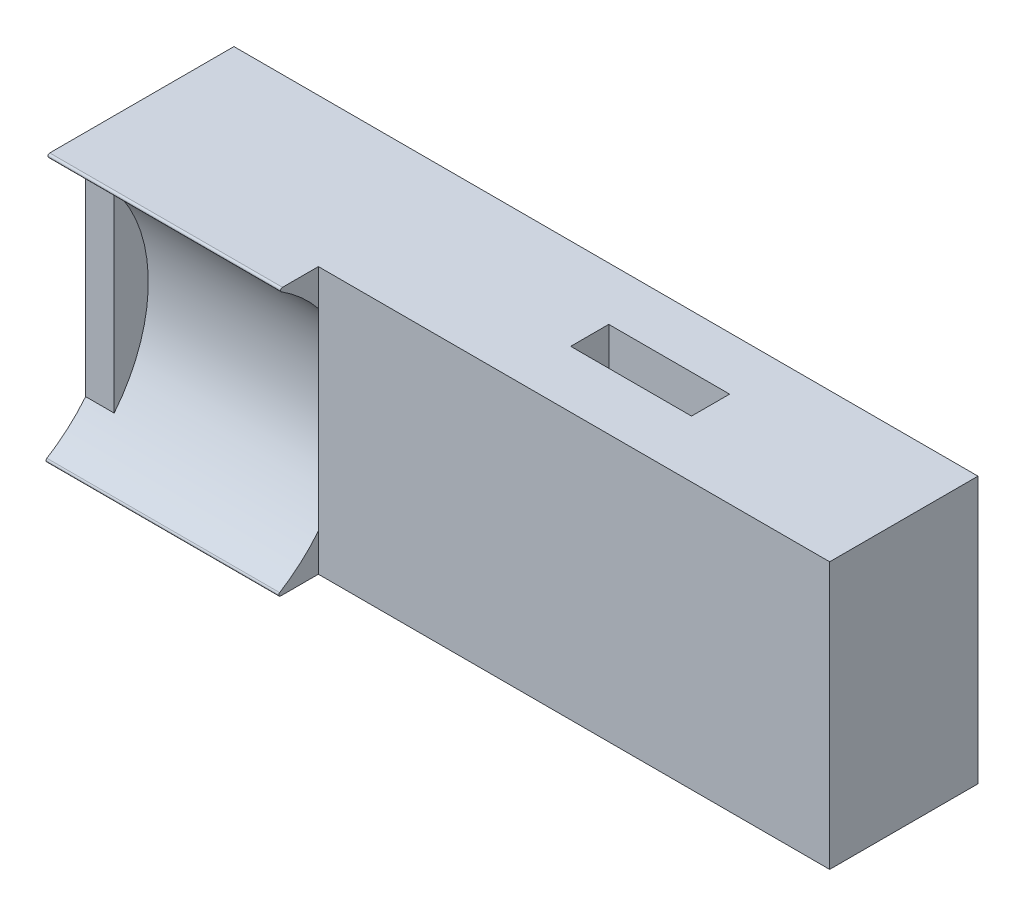
ISO-10303-21;
HEADER;
FILE_DESCRIPTION(('STEP AP214'),'2;1');
FILE_NAME('part.step','',(''),(''),'','','');
FILE_SCHEMA(('AUTOMOTIVE_DESIGN { 1 0 10303 214 1 1 1 1 }'));
ENDSEC;
DATA;
#1=APPLICATION_CONTEXT('core data for automotive mechanical design processes');
#2=APPLICATION_PROTOCOL_DEFINITION('international standard','automotive_design',2000,#1);
#3=PRODUCT_CONTEXT('',#1,'mechanical');
#4=PRODUCT('Part','Part','',(#3));
#5=PRODUCT_RELATED_PRODUCT_CATEGORY('part','',(#4));
#6=PRODUCT_DEFINITION_FORMATION('','',#4);
#7=PRODUCT_DEFINITION_CONTEXT('part definition',#1,'design');
#8=PRODUCT_DEFINITION('design','',#6,#7);
#9=PRODUCT_DEFINITION_SHAPE('','',#8);
#10=(LENGTH_UNIT() NAMED_UNIT(*) SI_UNIT(.MILLI.,.METRE.));
#11=(NAMED_UNIT(*) PLANE_ANGLE_UNIT() SI_UNIT($,.RADIAN.));
#12=(NAMED_UNIT(*) SI_UNIT($,.STERADIAN.) SOLID_ANGLE_UNIT());
#13=UNCERTAINTY_MEASURE_WITH_UNIT(LENGTH_MEASURE(1.E-05),#10,'distance_accuracy_value','');
#14=(GEOMETRIC_REPRESENTATION_CONTEXT(3) GLOBAL_UNCERTAINTY_ASSIGNED_CONTEXT((#13)) GLOBAL_UNIT_ASSIGNED_CONTEXT((#10,
#11,#12)) REPRESENTATION_CONTEXT('',''));
#15=CARTESIAN_POINT('',(0.,0.,0.));
#16=DIRECTION('',(0.,0.,1.));
#17=DIRECTION('',(1.,0.,0.));
#18=AXIS2_PLACEMENT_3D('',#15,#16,#17);
#19=CARTESIAN_POINT('',(-0.0551696547217584,-0.0306395827444961,-10.0199708088483));
#20=DIRECTION('',(1.,0.,0.));
#21=DIRECTION('',(0.,1.,0.));
#22=AXIS2_PLACEMENT_3D('',#19,#20,#21);
#23=PLANE('',#22);
#24=CARTESIAN_POINT('',(-0.0551696547217584,0.,0.));
#25=DIRECTION('',(-1.,0.,0.));
#26=DIRECTION('',(0.,1.,0.));
#27=AXIS2_PLACEMENT_3D('',#24,#25,#26);
#28=CIRCLE('',#27,8.04);
#29=CARTESIAN_POINT('',(-0.0551696547217584,5.06265492472644,-6.24588865680002));
#30=VERTEX_POINT('',#29);
#31=CARTESIAN_POINT('',(-0.0551696547217584,-5.06265492472644,-6.24588865680002));
#32=VERTEX_POINT('',#31);
#33=EDGE_CURVE('E178',#30,#32,#28,.T.);
#34=ORIENTED_EDGE('',*,*,#33,.T.);
#35=DIRECTION('',(0.,1.,0.));
#36=VECTOR('',#35,1.);
#37=CARTESIAN_POINT('',(-0.0551696547217584,3.4693604172555,-6.24588865680002));
#38=LINE('',#37,#36);
#39=EDGE_CURVE('E151',#32,#30,#38,.T.);
#40=ORIENTED_EDGE('',*,*,#39,.T.);
#41=EDGE_LOOP('',(#34,#40));
#42=FACE_BOUND('',#41,.T.);
#43=ADVANCED_FACE('F16',(#42),#23,.F.);
#44=CARTESIAN_POINT('',(-0.0551696547217584,-7.0306395827445,-6.));
#45=DIRECTION('',(0.,-1.,0.));
#46=DIRECTION('',(0.,0.,-1.));
#47=AXIS2_PLACEMENT_3D('',#44,#45,#46);
#48=PLANE('',#47);
#49=DIRECTION('',(0.,0.,-1.));
#50=VECTOR('',#49,1.);
#51=CARTESIAN_POINT('',(16.5523303452782,-7.0306395827445,-7.62294432840001));
#52=LINE('',#51,#50);
#53=CARTESIAN_POINT('',(16.5523303452782,-7.0306395827445,-9.24588865680002));
#54=VERTEX_POINT('',#53);
#55=CARTESIAN_POINT('',(16.5523303452782,-7.03063958274449,-11.2458886568));
#56=VERTEX_POINT('',#55);
#57=EDGE_CURVE('E276',#54,#56,#52,.T.);
#58=ORIENTED_EDGE('',*,*,#57,.T.);
#59=DIRECTION('',(-1.,0.,0.));
#60=VECTOR('',#59,1.);
#61=CARTESIAN_POINT('',(8.24858034527824,-7.03063958274449,-11.2458886568));
#62=LINE('',#61,#60);
#63=CARTESIAN_POINT('',(10.2023303452782,-7.03063958274449,-11.2458886568));
#64=VERTEX_POINT('',#63);
#65=EDGE_CURVE('E278',#56,#64,#62,.T.);
#66=ORIENTED_EDGE('',*,*,#65,.T.);
#67=DIRECTION('',(0.,0.,1.));
#68=VECTOR('',#67,1.);
#69=CARTESIAN_POINT('',(10.2023303452782,-7.0306395827445,-8.62294432840002));
#70=LINE('',#69,#68);
#71=CARTESIAN_POINT('',(10.2023303452782,-7.0306395827445,-9.24588865680001));
#72=VERTEX_POINT('',#71);
#73=EDGE_CURVE('E210',#64,#72,#70,.T.);
#74=ORIENTED_EDGE('',*,*,#73,.T.);
#75=DIRECTION('',(1.,0.,0.));
#76=VECTOR('',#75,1.);
#77=CARTESIAN_POINT('',(5.07358034527824,-7.0306395827445,-9.24588865680001));
#78=LINE('',#77,#76);
#79=EDGE_CURVE('E243',#72,#54,#78,.T.);
#80=ORIENTED_EDGE('',*,*,#79,.T.);
#81=EDGE_LOOP('',(#58,#66,#74,#80));
#82=FACE_BOUND('',#81,.T.);
#83=DIRECTION('',(1.,0.,0.));
#84=VECTOR('',#83,1.);
#85=CARTESIAN_POINT('',(-10.05,-7.0306395827445,-4.2621065702026));
#86=LINE('',#85,#84);
#87=CARTESIAN_POINT('',(-12.285,-7.0306395827445,-4.2621065702026));
#88=VERTEX_POINT('',#87);
#89=CARTESIAN_POINT('',(-0.0551696547217584,-7.0306395827445,-4.2621065702026));
#90=VERTEX_POINT('',#89);
#91=EDGE_CURVE('E294',#88,#90,#86,.T.);
#92=ORIENTED_EDGE('',*,*,#91,.F.);
#93=DIRECTION('',(0.,0.,1.));
#94=VECTOR('',#93,1.);
#95=CARTESIAN_POINT('',(-12.285,-7.03063958274449,-14.0399416176966));
#96=LINE('',#95,#94);
#97=CARTESIAN_POINT('',(-12.285,-7.03063958274449,-14.0399416176966));
#98=VERTEX_POINT('',#97);
#99=EDGE_CURVE('E204',#98,#88,#96,.T.);
#100=ORIENTED_EDGE('',*,*,#99,.F.);
#101=DIRECTION('',(-1.,0.,0.));
#102=VECTOR('',#101,1.);
#103=CARTESIAN_POINT('',(-10.05,-7.03063958274449,-14.0399416176966));
#104=LINE('',#103,#102);
#105=CARTESIAN_POINT('',(26.8098303452782,-7.03063958274449,-14.0399416176966));
#106=VERTEX_POINT('',#105);
#107=EDGE_CURVE('E11',#106,#98,#104,.T.);
#108=ORIENTED_EDGE('',*,*,#107,.F.);
#109=DIRECTION('',(0.,0.,-1.));
#110=VECTOR('',#109,1.);
#111=CARTESIAN_POINT('',(26.8098303452782,-7.0306395827445,-3.90021884739129));
#112=LINE('',#111,#110);
#113=CARTESIAN_POINT('',(26.8098303452782,-7.0306395827445,-6.24588865680002));
#114=VERTEX_POINT('',#113);
#115=EDGE_CURVE('E247',#114,#106,#112,.T.);
#116=ORIENTED_EDGE('',*,*,#115,.F.);
#117=DIRECTION('',(-1.,0.,0.));
#118=VECTOR('',#117,1.);
#119=CARTESIAN_POINT('',(-0.0551696547217584,-7.0306395827445,-6.24588865680002));
#120=LINE('',#119,#118);
#121=CARTESIAN_POINT('',(-0.0551696547217584,-7.0306395827445,-6.24588865680002));
#122=VERTEX_POINT('',#121);
#123=EDGE_CURVE('E176',#114,#122,#120,.T.);
#124=ORIENTED_EDGE('',*,*,#123,.T.);
#125=DIRECTION('',(0.,0.,-1.));
#126=VECTOR('',#125,1.);
#127=CARTESIAN_POINT('',(-0.0551696547217584,-7.03063958274449,-14.0399416176966));
#128=LINE('',#127,#126);
#129=EDGE_CURVE('E174',#90,#122,#128,.T.);
#130=ORIENTED_EDGE('',*,*,#129,.F.);
#131=EDGE_LOOP('',(#92,#100,#108,#116,#124,#130));
#132=FACE_BOUND('',#131,.T.);
#133=ADVANCED_FACE('F663',(#82,#132),#48,.T.);
#134=CARTESIAN_POINT('',(-0.0551696547217584,-7.03063958274449,-14.0399416176966));
#135=DIRECTION('',(0.,0.,-1.));
#136=DIRECTION('',(0.,-1.,0.));
#137=AXIS2_PLACEMENT_3D('',#134,#135,#136);
#138=PLANE('',#137);
#139=CARTESIAN_POINT('',(20.7124151726391,-0.0306395827444939,-14.0399416176966));
#140=DIRECTION('',(0.,0.,1.));
#141=DIRECTION('',(1.,0.,0.));
#142=AXIS2_PLACEMENT_3D('',#139,#140,#141);
#143=CIRCLE('',#142,1.5);
#144=CARTESIAN_POINT('',(19.2124151726391,-0.0306395827444937,-14.0399416176966));
#145=VERTEX_POINT('',#144);
#146=EDGE_CURVE('E198',#145,#145,#143,.T.);
#147=ORIENTED_EDGE('',*,*,#146,.T.);
#148=EDGE_LOOP('',(#147));
#149=FACE_BOUND('',#148,.T.);
#150=CARTESIAN_POINT('',(8.01241517263912,-0.0306395827444939,-14.0399416176966));
#151=DIRECTION('',(0.,0.,1.));
#152=DIRECTION('',(1.,0.,0.));
#153=AXIS2_PLACEMENT_3D('',#150,#151,#152);
#154=CIRCLE('',#153,1.5);
#155=CARTESIAN_POINT('',(6.51241517263912,-0.0306395827444937,-14.0399416176966));
#156=VERTEX_POINT('',#155);
#157=EDGE_CURVE('E255',#156,#156,#154,.T.);
#158=ORIENTED_EDGE('',*,*,#157,.T.);
#159=EDGE_LOOP('',(#158));
#160=FACE_BOUND('',#159,.T.);
#161=CARTESIAN_POINT('',(-4.68758482736088,-0.0306395827444939,-14.0399416176966));
#162=DIRECTION('',(0.,0.,1.));
#163=DIRECTION('',(1.,0.,0.));
#164=AXIS2_PLACEMENT_3D('',#161,#162,#163);
#165=CIRCLE('',#164,1.5);
#166=CARTESIAN_POINT('',(-6.18758482736088,-0.0306395827444937,-14.0399416176966));
#167=VERTEX_POINT('',#166);
#168=EDGE_CURVE('E226',#167,#167,#165,.T.);
#169=ORIENTED_EDGE('',*,*,#168,.T.);
#170=EDGE_LOOP('',(#169));
#171=FACE_BOUND('',#170,.T.);
#172=DIRECTION('',(-1.,0.,0.));
#173=VECTOR('',#172,1.);
#174=CARTESIAN_POINT('',(-10.05,6.96936041725551,-14.0399416176966));
#175=LINE('',#174,#173);
#176=CARTESIAN_POINT('',(26.8098303452782,6.96936041725551,-14.0399416176966));
#177=VERTEX_POINT('',#176);
#178=CARTESIAN_POINT('',(-12.285,6.96936041725551,-14.0399416176966));
#179=VERTEX_POINT('',#178);
#180=EDGE_CURVE('E244',#177,#179,#175,.T.);
#181=ORIENTED_EDGE('',*,*,#180,.F.);
#182=DIRECTION('',(0.,1.,0.));
#183=VECTOR('',#182,1.);
#184=CARTESIAN_POINT('',(26.8098303452782,-7.03063958274449,-14.0399416176966));
#185=LINE('',#184,#183);
#186=EDGE_CURVE('E27',#106,#177,#185,.T.);
#187=ORIENTED_EDGE('',*,*,#186,.F.);
#188=ORIENTED_EDGE('',*,*,#107,.T.);
#189=DIRECTION('',(0.,-1.,0.));
#190=VECTOR('',#189,1.);
#191=CARTESIAN_POINT('',(-12.285,6.96936041725551,-14.0399416176966));
#192=LINE('',#191,#190);
#193=EDGE_CURVE('E209',#179,#98,#192,.T.);
#194=ORIENTED_EDGE('',*,*,#193,.F.);
#195=EDGE_LOOP('',(#181,#187,#188,#194));
#196=FACE_BOUND('',#195,.T.);
#197=ADVANCED_FACE('F585',(#149,#160,#171,#196),#138,.T.);
#198=CARTESIAN_POINT('',(26.8098303452782,-0.0306395827444961,-10.0199708088483));
#199=DIRECTION('',(1.,0.,0.));
#200=DIRECTION('',(0.,1.,0.));
#201=AXIS2_PLACEMENT_3D('',#198,#199,#200);
#202=PLANE('',#201);
#203=DIRECTION('',(0.,-1.,0.));
#204=VECTOR('',#203,1.);
#205=CARTESIAN_POINT('',(26.8098303452782,3.4693604172555,-6.24588865680002));
#206=LINE('',#205,#204);
#207=CARTESIAN_POINT('',(26.8098303452782,6.9693604172555,-6.2458886568));
#208=VERTEX_POINT('',#207);
#209=EDGE_CURVE('E217',#208,#114,#206,.T.);
#210=ORIENTED_EDGE('',*,*,#209,.T.);
#211=ORIENTED_EDGE('',*,*,#115,.T.);
#212=ORIENTED_EDGE('',*,*,#186,.T.);
#213=DIRECTION('',(0.,0.,1.));
#214=VECTOR('',#213,1.);
#215=CARTESIAN_POINT('',(26.8098303452782,6.96936041725551,-14.0399416176966));
#216=LINE('',#215,#214);
#217=EDGE_CURVE('E164',#177,#208,#216,.T.);
#218=ORIENTED_EDGE('',*,*,#217,.T.);
#219=EDGE_LOOP('',(#210,#211,#212,#218));
#220=FACE_BOUND('',#219,.T.);
#221=ADVANCED_FACE('F577',(#220),#202,.T.);
#222=CARTESIAN_POINT('',(-0.0551696547217584,6.96936041725551,-14.0399416176966));
#223=DIRECTION('',(0.,1.,0.));
#224=DIRECTION('',(0.,0.,-1.));
#225=AXIS2_PLACEMENT_3D('',#222,#223,#224);
#226=PLANE('',#225);
#227=DIRECTION('',(0.,0.,1.));
#228=VECTOR('',#227,1.);
#229=CARTESIAN_POINT('',(16.5523303452782,6.9693604172555,-11.6429151372483));
#230=LINE('',#229,#228);
#231=CARTESIAN_POINT('',(16.5523303452782,6.9693604172555,-11.2458886568));
#232=VERTEX_POINT('',#231);
#233=CARTESIAN_POINT('',(16.5523303452782,6.9693604172555,-9.24588865680001));
#234=VERTEX_POINT('',#233);
#235=EDGE_CURVE('E318',#232,#234,#230,.T.);
#236=ORIENTED_EDGE('',*,*,#235,.T.);
#237=DIRECTION('',(-1.,0.,0.));
#238=VECTOR('',#237,1.);
#239=CARTESIAN_POINT('',(5.07358034527824,6.9693604172555,-9.2458886568));
#240=LINE('',#239,#238);
#241=CARTESIAN_POINT('',(10.2023303452782,6.9693604172555,-9.2458886568));
#242=VERTEX_POINT('',#241);
#243=EDGE_CURVE('E250',#234,#242,#240,.T.);
#244=ORIENTED_EDGE('',*,*,#243,.T.);
#245=DIRECTION('',(0.,0.,-1.));
#246=VECTOR('',#245,1.);
#247=CARTESIAN_POINT('',(10.2023303452782,6.9693604172555,-12.6429151372483));
#248=LINE('',#247,#246);
#249=CARTESIAN_POINT('',(10.2023303452782,6.9693604172555,-11.2458886568));
#250=VERTEX_POINT('',#249);
#251=EDGE_CURVE('E20',#242,#250,#248,.T.);
#252=ORIENTED_EDGE('',*,*,#251,.T.);
#253=DIRECTION('',(1.,0.,0.));
#254=VECTOR('',#253,1.);
#255=CARTESIAN_POINT('',(8.24858034527824,6.9693604172555,-11.2458886568));
#256=LINE('',#255,#254);
#257=EDGE_CURVE('E282',#250,#232,#256,.T.);
#258=ORIENTED_EDGE('',*,*,#257,.T.);
#259=EDGE_LOOP('',(#236,#244,#252,#258));
#260=FACE_BOUND('',#259,.T.);
#261=DIRECTION('',(-1.,0.,0.));
#262=VECTOR('',#261,1.);
#263=CARTESIAN_POINT('',(-10.05,6.96936041725549,-4.36021215265661));
#264=LINE('',#263,#262);
#265=CARTESIAN_POINT('',(-0.0551696547217584,6.96936041725549,-4.36021215265661));
#266=VERTEX_POINT('',#265);
#267=CARTESIAN_POINT('',(-12.285,6.96936041725549,-4.36021215265661));
#268=VERTEX_POINT('',#267);
#269=EDGE_CURVE('E218',#266,#268,#264,.T.);
#270=ORIENTED_EDGE('',*,*,#269,.F.);
#271=DIRECTION('',(0.,0.,1.));
#272=VECTOR('',#271,1.);
#273=CARTESIAN_POINT('',(-0.0551696547217584,6.96936041725549,-2.03994161769656));
#274=LINE('',#273,#272);
#275=CARTESIAN_POINT('',(-0.0551696547217584,6.9693604172555,-6.2458886568));
#276=VERTEX_POINT('',#275);
#277=EDGE_CURVE('E193',#276,#266,#274,.T.);
#278=ORIENTED_EDGE('',*,*,#277,.F.);
#279=DIRECTION('',(1.,0.,0.));
#280=VECTOR('',#279,1.);
#281=CARTESIAN_POINT('',(-0.0551696547217584,6.9693604172555,-6.24588865680002));
#282=LINE('',#281,#280);
#283=EDGE_CURVE('E165',#276,#208,#282,.T.);
#284=ORIENTED_EDGE('',*,*,#283,.T.);
#285=ORIENTED_EDGE('',*,*,#217,.F.);
#286=ORIENTED_EDGE('',*,*,#180,.T.);
#287=DIRECTION('',(0.,0.,-1.));
#288=VECTOR('',#287,1.);
#289=CARTESIAN_POINT('',(-12.285,6.96936041725549,-4.36021215265661));
#290=LINE('',#289,#288);
#291=EDGE_CURVE('E309',#268,#179,#290,.T.);
#292=ORIENTED_EDGE('',*,*,#291,.F.);
#293=EDGE_LOOP('',(#270,#278,#284,#285,#286,#292));
#294=FACE_BOUND('',#293,.T.);
#295=ADVANCED_FACE('F372',(#260,#294),#226,.T.);
#296=CARTESIAN_POINT('',(-0.0551696547217584,6.9693604172555,-6.24588865680002));
#297=DIRECTION('',(0.,0.,-1.));
#298=DIRECTION('',(0.,-1.,0.));
#299=AXIS2_PLACEMENT_3D('',#296,#297,#298);
#300=PLANE('',#299);
#301=DIRECTION('',(0.,1.,0.));
#302=VECTOR('',#301,1.);
#303=CARTESIAN_POINT('',(-0.0551696547217584,3.4693604172555,-6.24588865680002));
#304=LINE('',#303,#302);
#305=EDGE_CURVE('E155',#122,#32,#304,.T.);
#306=ORIENTED_EDGE('',*,*,#305,.F.);
#307=ORIENTED_EDGE('',*,*,#123,.F.);
#308=ORIENTED_EDGE('',*,*,#209,.F.);
#309=ORIENTED_EDGE('',*,*,#283,.F.);
#310=DIRECTION('',(0.,1.,0.));
#311=VECTOR('',#310,1.);
#312=CARTESIAN_POINT('',(-0.0551696547217584,3.4693604172555,-6.24588865680002));
#313=LINE('',#312,#311);
#314=EDGE_CURVE('E158',#30,#276,#313,.T.);
#315=ORIENTED_EDGE('',*,*,#314,.F.);
#316=ORIENTED_EDGE('',*,*,#39,.F.);
#317=EDGE_LOOP('',(#306,#307,#308,#309,#315,#316));
#318=FACE_BOUND('',#317,.T.);
#319=ADVANCED_FACE('F153',(#318),#300,.F.);
#320=CARTESIAN_POINT('',(-0.0551696547217584,0.,-2.99997080884829));
#321=DIRECTION('',(-1.,0.,0.));
#322=DIRECTION('',(0.,0.,1.));
#323=AXIS2_PLACEMENT_3D('',#320,#321,#322);
#324=PLANE('',#323);
#325=CARTESIAN_POINT('',(-0.0551696547217584,-6.9326395827445,-4.2621065702026));
#326=DIRECTION('',(-1.,0.,0.));
#327=DIRECTION('',(0.,-0.272135138531365,0.962259043281233));
#328=AXIS2_PLACEMENT_3D('',#325,#326,#327);
#329=CIRCLE('',#328,0.098);
#330=CARTESIAN_POINT('',(-0.0551696547217584,-6.8491548593347,-4.21078112858551));
#331=VERTEX_POINT('',#330);
#332=EDGE_CURVE('E181',#90,#331,#329,.T.);
#333=ORIENTED_EDGE('',*,*,#332,.F.);
#334=ORIENTED_EDGE('',*,*,#129,.T.);
#335=ORIENTED_EDGE('',*,*,#305,.T.);
#336=CARTESIAN_POINT('',(-0.0551696547217584,0.,0.));
#337=DIRECTION('',(-1.,0.,0.));
#338=DIRECTION('',(0.,1.,0.));
#339=AXIS2_PLACEMENT_3D('',#336,#337,#338);
#340=CIRCLE('',#339,8.04);
#341=EDGE_CURVE('E172',#32,#331,#340,.T.);
#342=ORIENTED_EDGE('',*,*,#341,.T.);
#343=EDGE_LOOP('',(#333,#334,#335,#342));
#344=FACE_BOUND('',#343,.T.);
#345=ADVANCED_FACE('F170',(#344),#324,.F.);
#346=CARTESIAN_POINT('',(-10.05,-6.9326395827445,-4.2621065702026));
#347=DIRECTION('',(1.,0.,0.));
#348=DIRECTION('',(0.,-0.272135138531365,0.962259043281233));
#349=AXIS2_PLACEMENT_3D('',#346,#347,#348);
#350=CYLINDRICAL_SURFACE('',#349,0.098);
#351=ORIENTED_EDGE('',*,*,#332,.T.);
#352=DIRECTION('',(-1.,0.,0.));
#353=VECTOR('',#352,1.);
#354=CARTESIAN_POINT('',(-10.05,-6.8491548593347,-4.21078112858551));
#355=LINE('',#354,#353);
#356=CARTESIAN_POINT('',(-12.285,-6.8491548593347,-4.21078112858551));
#357=VERTEX_POINT('',#356);
#358=EDGE_CURVE('E186',#331,#357,#355,.T.);
#359=ORIENTED_EDGE('',*,*,#358,.T.);
#360=CARTESIAN_POINT('',(-12.285,-6.9326395827445,-4.2621065702026));
#361=DIRECTION('',(-1.,0.,0.));
#362=DIRECTION('',(0.,-1.,0.));
#363=AXIS2_PLACEMENT_3D('',#360,#361,#362);
#364=CIRCLE('',#363,0.097999999999997);
#365=EDGE_CURVE('E208',#88,#357,#364,.T.);
#366=ORIENTED_EDGE('',*,*,#365,.F.);
#367=ORIENTED_EDGE('',*,*,#91,.T.);
#368=EDGE_LOOP('',(#351,#359,#366,#367));
#369=FACE_BOUND('',#368,.T.);
#370=ADVANCED_FACE('F594',(#369),#350,.T.);
#371=CARTESIAN_POINT('',(-10.05,0.,0.));
#372=DIRECTION('',(1.,0.,0.));
#373=DIRECTION('',(0.,1.,0.));
#374=AXIS2_PLACEMENT_3D('',#371,#372,#373);
#375=CYLINDRICAL_SURFACE('',#374,8.04);
#376=DIRECTION('',(1.,0.,0.));
#377=VECTOR('',#376,1.);
#378=CARTESIAN_POINT('',(-10.05,6.78861363415264,-4.30770529704585));
#379=LINE('',#378,#377);
#380=CARTESIAN_POINT('',(-12.285,6.78861363415264,-4.30770529704585));
#381=VERTEX_POINT('',#380);
#382=CARTESIAN_POINT('',(-0.0551696547217584,6.78861363415264,-4.30770529704585));
#383=VERTEX_POINT('',#382);
#384=EDGE_CURVE('E222',#381,#383,#379,.T.);
#385=ORIENTED_EDGE('',*,*,#384,.F.);
#386=CARTESIAN_POINT('',(-12.285,0.,0.));
#387=DIRECTION('',(1.,0.,0.));
#388=DIRECTION('',(0.,0.844354929620975,-0.535784240926101));
#389=AXIS2_PLACEMENT_3D('',#386,#387,#388);
#390=CIRCLE('',#389,8.04);
#391=CARTESIAN_POINT('',(-12.285,5.06265492472644,-6.24588865680002));
#392=VERTEX_POINT('',#391);
#393=EDGE_CURVE('E227',#392,#381,#390,.T.);
#394=ORIENTED_EDGE('',*,*,#393,.F.);
#395=DIRECTION('',(-1.,0.,0.));
#396=VECTOR('',#395,1.);
#397=CARTESIAN_POINT('',(-10.785,5.06265492472644,-6.24588865680002));
#398=LINE('',#397,#396);
#399=CARTESIAN_POINT('',(-10.785,5.06265492472644,-6.24588865680002));
#400=VERTEX_POINT('',#399);
#401=EDGE_CURVE('E338',#400,#392,#398,.T.);
#402=ORIENTED_EDGE('',*,*,#401,.F.);
#403=CARTESIAN_POINT('',(-10.785,0.,0.));
#404=DIRECTION('',(1.,0.,0.));
#405=DIRECTION('',(0.,1.,0.));
#406=AXIS2_PLACEMENT_3D('',#403,#404,#405);
#407=CIRCLE('',#406,8.04);
#408=CARTESIAN_POINT('',(-10.785,-5.06265492472644,-6.24588865680002));
#409=VERTEX_POINT('',#408);
#410=EDGE_CURVE('E224',#409,#400,#407,.T.);
#411=ORIENTED_EDGE('',*,*,#410,.F.);
#412=DIRECTION('',(-1.,0.,0.));
#413=VECTOR('',#412,1.);
#414=CARTESIAN_POINT('',(-10.785,-5.06265492472644,-6.24588865680002));
#415=LINE('',#414,#413);
#416=CARTESIAN_POINT('',(-12.285,-5.06265492472644,-6.24588865680002));
#417=VERTEX_POINT('',#416);
#418=EDGE_CURVE('E229',#409,#417,#415,.T.);
#419=ORIENTED_EDGE('',*,*,#418,.T.);
#420=CARTESIAN_POINT('',(-12.285,0.,0.));
#421=DIRECTION('',(1.,0.,0.));
#422=DIRECTION('',(0.,0.844354929620975,-0.535784240926101));
#423=AXIS2_PLACEMENT_3D('',#420,#421,#422);
#424=CIRCLE('',#423,8.04);
#425=EDGE_CURVE('E267',#357,#417,#424,.T.);
#426=ORIENTED_EDGE('',*,*,#425,.F.);
#427=ORIENTED_EDGE('',*,*,#358,.F.);
#428=ORIENTED_EDGE('',*,*,#341,.F.);
#429=ORIENTED_EDGE('',*,*,#33,.F.);
#430=CARTESIAN_POINT('',(-0.0551696547217584,0.,0.));
#431=DIRECTION('',(-1.,0.,0.));
#432=DIRECTION('',(0.,1.,0.));
#433=AXIS2_PLACEMENT_3D('',#430,#431,#432);
#434=CIRCLE('',#433,8.04);
#435=EDGE_CURVE('E259',#383,#30,#434,.T.);
#436=ORIENTED_EDGE('',*,*,#435,.F.);
#437=EDGE_LOOP('',(#385,#394,#402,#411,#419,#426,#427,#428,#429,#436));
#438=FACE_BOUND('',#437,.T.);
#439=ADVANCED_FACE('F184',(#438),#375,.F.);
#440=CARTESIAN_POINT('',(-0.0551696547217584,0.,-2.99997080884829));
#441=DIRECTION('',(-1.,0.,0.));
#442=DIRECTION('',(0.,0.,1.));
#443=AXIS2_PLACEMENT_3D('',#440,#441,#442);
#444=PLANE('',#443);
#445=CARTESIAN_POINT('',(-0.0551696547217584,6.87136041725549,-4.36021215265661));
#446=DIRECTION('',(-1.,0.,0.));
#447=DIRECTION('',(0.,0.278966906979182,0.960300715823157));
#448=AXIS2_PLACEMENT_3D('',#445,#446,#447);
#449=CIRCLE('',#448,0.098);
#450=EDGE_CURVE('E223',#383,#266,#449,.T.);
#451=ORIENTED_EDGE('',*,*,#450,.F.);
#452=ORIENTED_EDGE('',*,*,#435,.T.);
#453=ORIENTED_EDGE('',*,*,#314,.T.);
#454=ORIENTED_EDGE('',*,*,#277,.T.);
#455=EDGE_LOOP('',(#451,#452,#453,#454));
#456=FACE_BOUND('',#455,.T.);
#457=ADVANCED_FACE('F610',(#456),#444,.F.);
#458=CARTESIAN_POINT('',(-10.05,6.87136041725549,-4.36021215265661));
#459=DIRECTION('',(1.,0.,0.));
#460=DIRECTION('',(0.,0.278966906979182,0.960300715823157));
#461=AXIS2_PLACEMENT_3D('',#458,#459,#460);
#462=CYLINDRICAL_SURFACE('',#461,0.098);
#463=ORIENTED_EDGE('',*,*,#450,.T.);
#464=ORIENTED_EDGE('',*,*,#269,.T.);
#465=CARTESIAN_POINT('',(-12.285,6.87136041725549,-4.36021215265661));
#466=DIRECTION('',(-1.,0.,0.));
#467=DIRECTION('',(0.,-0.844354929620978,0.535784240926097));
#468=AXIS2_PLACEMENT_3D('',#465,#466,#467);
#469=CIRCLE('',#468,0.098);
#470=EDGE_CURVE('E233',#381,#268,#469,.T.);
#471=ORIENTED_EDGE('',*,*,#470,.F.);
#472=ORIENTED_EDGE('',*,*,#384,.T.);
#473=EDGE_LOOP('',(#463,#464,#471,#472));
#474=FACE_BOUND('',#473,.T.);
#475=ADVANCED_FACE('F606',(#474),#462,.T.);
#476=CARTESIAN_POINT('',(16.5523303452782,-7.03063958274449,-11.2458886568));
#477=DIRECTION('',(0.,0.,-1.));
#478=DIRECTION('',(-1.,0.,0.));
#479=AXIS2_PLACEMENT_3D('',#476,#477,#478);
#480=PLANE('',#479);
#481=ORIENTED_EDGE('',*,*,#257,.F.);
#482=DIRECTION('',(0.,1.,0.));
#483=VECTOR('',#482,1.);
#484=CARTESIAN_POINT('',(10.2023303452782,-7.03063958274449,-11.2458886568));
#485=LINE('',#484,#483);
#486=EDGE_CURVE('E213',#64,#250,#485,.T.);
#487=ORIENTED_EDGE('',*,*,#486,.F.);
#488=ORIENTED_EDGE('',*,*,#65,.F.);
#489=DIRECTION('',(0.,1.,0.));
#490=VECTOR('',#489,1.);
#491=CARTESIAN_POINT('',(16.5523303452782,-7.03063958274449,-11.2458886568));
#492=LINE('',#491,#490);
#493=EDGE_CURVE('E315',#56,#232,#492,.T.);
#494=ORIENTED_EDGE('',*,*,#493,.T.);
#495=EDGE_LOOP('',(#481,#487,#488,#494));
#496=FACE_BOUND('',#495,.T.);
#497=ADVANCED_FACE('F382',(#496),#480,.F.);
#498=CARTESIAN_POINT('',(10.2023303452782,-7.03063958274449,-11.2458886568));
#499=DIRECTION('',(-1.,0.,0.));
#500=DIRECTION('',(0.,1.,0.));
#501=AXIS2_PLACEMENT_3D('',#498,#499,#500);
#502=PLANE('',#501);
#503=ORIENTED_EDGE('',*,*,#251,.F.);
#504=DIRECTION('',(0.,1.,0.));
#505=VECTOR('',#504,1.);
#506=CARTESIAN_POINT('',(10.2023303452782,-7.0306395827445,-9.24588865680001));
#507=LINE('',#506,#505);
#508=EDGE_CURVE('E239',#72,#242,#507,.T.);
#509=ORIENTED_EDGE('',*,*,#508,.F.);
#510=ORIENTED_EDGE('',*,*,#73,.F.);
#511=ORIENTED_EDGE('',*,*,#486,.T.);
#512=EDGE_LOOP('',(#503,#509,#510,#511));
#513=FACE_BOUND('',#512,.T.);
#514=ADVANCED_FACE('F394',(#513),#502,.F.);
#515=CARTESIAN_POINT('',(10.2023303452782,-7.0306395827445,-9.24588865680001));
#516=DIRECTION('',(0.,0.,1.));
#517=DIRECTION('',(0.,-1.,0.));
#518=AXIS2_PLACEMENT_3D('',#515,#516,#517);
#519=PLANE('',#518);
#520=ORIENTED_EDGE('',*,*,#243,.F.);
#521=DIRECTION('',(0.,1.,0.));
#522=VECTOR('',#521,1.);
#523=CARTESIAN_POINT('',(16.5523303452782,-7.0306395827445,-9.24588865680002));
#524=LINE('',#523,#522);
#525=EDGE_CURVE('E273',#54,#234,#524,.T.);
#526=ORIENTED_EDGE('',*,*,#525,.F.);
#527=ORIENTED_EDGE('',*,*,#79,.F.);
#528=ORIENTED_EDGE('',*,*,#508,.T.);
#529=EDGE_LOOP('',(#520,#526,#527,#528));
#530=FACE_BOUND('',#529,.T.);
#531=ADVANCED_FACE('F389',(#530),#519,.F.);
#532=CARTESIAN_POINT('',(16.5523303452782,-7.0306395827445,-9.24588865680002));
#533=DIRECTION('',(1.,0.,0.));
#534=DIRECTION('',(0.,0.,1.));
#535=AXIS2_PLACEMENT_3D('',#532,#533,#534);
#536=PLANE('',#535);
#537=ORIENTED_EDGE('',*,*,#235,.F.);
#538=ORIENTED_EDGE('',*,*,#493,.F.);
#539=ORIENTED_EDGE('',*,*,#57,.F.);
#540=ORIENTED_EDGE('',*,*,#525,.T.);
#541=EDGE_LOOP('',(#537,#538,#539,#540));
#542=FACE_BOUND('',#541,.T.);
#543=ADVANCED_FACE('F385',(#542),#536,.F.);
#544=CARTESIAN_POINT('',(20.7124151726391,-0.0306395827444904,-8.53994161769657));
#545=DIRECTION('',(0.,0.,-1.));
#546=DIRECTION('',(0.,-1.,0.));
#547=AXIS2_PLACEMENT_3D('',#544,#545,#546);
#548=PLANE('',#547);
#549=CARTESIAN_POINT('',(20.7124151726391,-0.0306395827444904,-8.53994161769657));
#550=DIRECTION('',(0.,0.,1.));
#551=DIRECTION('',(1.,0.,0.));
#552=AXIS2_PLACEMENT_3D('',#549,#550,#551);
#553=CIRCLE('',#552,1.5);
#554=CARTESIAN_POINT('',(19.2124151726391,-0.0306395827444902,-8.53994161769657));
#555=VERTEX_POINT('',#554);
#556=EDGE_CURVE('E238',#555,#555,#553,.T.);
#557=ORIENTED_EDGE('',*,*,#556,.F.);
#558=EDGE_LOOP('',(#557));
#559=FACE_BOUND('',#558,.T.);
#560=ADVANCED_FACE('F672',(#559),#548,.T.);
#561=CARTESIAN_POINT('',(20.7124151726391,-0.0306395827444939,-14.0399416176966));
#562=DIRECTION('',(0.,0.,1.));
#563=DIRECTION('',(1.,0.,0.));
#564=AXIS2_PLACEMENT_3D('',#561,#562,#563);
#565=CYLINDRICAL_SURFACE('',#564,1.5);
#566=ORIENTED_EDGE('',*,*,#146,.F.);
#567=DIRECTION('',(0.,0.,1.));
#568=VECTOR('',#567,1.);
#569=CARTESIAN_POINT('',(19.2124151726391,-0.0306395827444941,-14.0399416176966));
#570=LINE('',#569,#568);
#571=EDGE_CURVE('E202',#145,#555,#570,.T.);
#572=ORIENTED_EDGE('',*,*,#571,.T.);
#573=ORIENTED_EDGE('',*,*,#556,.T.);
#574=ORIENTED_EDGE('',*,*,#571,.F.);
#575=EDGE_LOOP('',(#566,#572,#573,#574));
#576=FACE_BOUND('',#575,.T.);
#577=ADVANCED_FACE('F559',(#576),#565,.F.);
#578=CARTESIAN_POINT('',(8.01241517263912,-0.0306395827444904,-8.53994161769657));
#579=DIRECTION('',(0.,0.,-1.));
#580=DIRECTION('',(0.,-1.,0.));
#581=AXIS2_PLACEMENT_3D('',#578,#579,#580);
#582=PLANE('',#581);
#583=CARTESIAN_POINT('',(8.01241517263912,-0.0306395827444904,-8.53994161769657));
#584=DIRECTION('',(0.,0.,1.));
#585=DIRECTION('',(1.,0.,0.));
#586=AXIS2_PLACEMENT_3D('',#583,#584,#585);
#587=CIRCLE('',#586,1.5);
#588=CARTESIAN_POINT('',(6.51241517263912,-0.0306395827444902,-8.53994161769657));
#589=VERTEX_POINT('',#588);
#590=EDGE_CURVE('E203',#589,#589,#587,.T.);
#591=ORIENTED_EDGE('',*,*,#590,.F.);
#592=EDGE_LOOP('',(#591));
#593=FACE_BOUND('',#592,.T.);
#594=ADVANCED_FACE('F18',(#593),#582,.T.);
#595=CARTESIAN_POINT('',(8.01241517263912,-0.0306395827444939,-14.0399416176966));
#596=DIRECTION('',(0.,0.,1.));
#597=DIRECTION('',(1.,0.,0.));
#598=AXIS2_PLACEMENT_3D('',#595,#596,#597);
#599=CYLINDRICAL_SURFACE('',#598,1.5);
#600=ORIENTED_EDGE('',*,*,#157,.F.);
#601=DIRECTION('',(0.,0.,1.));
#602=VECTOR('',#601,1.);
#603=CARTESIAN_POINT('',(6.51241517263912,-0.0306395827444941,-14.0399416176966));
#604=LINE('',#603,#602);
#605=EDGE_CURVE('E251',#156,#589,#604,.T.);
#606=ORIENTED_EDGE('',*,*,#605,.T.);
#607=ORIENTED_EDGE('',*,*,#590,.T.);
#608=ORIENTED_EDGE('',*,*,#605,.F.);
#609=EDGE_LOOP('',(#600,#606,#607,#608));
#610=FACE_BOUND('',#609,.T.);
#611=ADVANCED_FACE('F558',(#610),#599,.F.);
#612=CARTESIAN_POINT('',(-4.68758482736088,-0.0306395827444904,-8.53994161769657));
#613=DIRECTION('',(0.,0.,-1.));
#614=DIRECTION('',(0.,-1.,0.));
#615=AXIS2_PLACEMENT_3D('',#612,#613,#614);
#616=PLANE('',#615);
#617=CARTESIAN_POINT('',(-4.68758482736088,-0.0306395827444904,-8.53994161769657));
#618=DIRECTION('',(0.,0.,1.));
#619=DIRECTION('',(1.,0.,0.));
#620=AXIS2_PLACEMENT_3D('',#617,#618,#619);
#621=CIRCLE('',#620,1.5);
#622=CARTESIAN_POINT('',(-6.18758482736088,-0.0306395827444902,-8.53994161769657));
#623=VERTEX_POINT('',#622);
#624=EDGE_CURVE('E264',#623,#623,#621,.T.);
#625=ORIENTED_EDGE('',*,*,#624,.F.);
#626=EDGE_LOOP('',(#625));
#627=FACE_BOUND('',#626,.T.);
#628=ADVANCED_FACE('F565',(#627),#616,.T.);
#629=CARTESIAN_POINT('',(-4.68758482736088,-0.0306395827444939,-14.0399416176966));
#630=DIRECTION('',(0.,0.,1.));
#631=DIRECTION('',(1.,0.,0.));
#632=AXIS2_PLACEMENT_3D('',#629,#630,#631);
#633=CYLINDRICAL_SURFACE('',#632,1.5);
#634=ORIENTED_EDGE('',*,*,#168,.F.);
#635=DIRECTION('',(0.,0.,1.));
#636=VECTOR('',#635,1.);
#637=CARTESIAN_POINT('',(-6.18758482736088,-0.0306395827444941,-14.0399416176966));
#638=LINE('',#637,#636);
#639=EDGE_CURVE('E260',#167,#623,#638,.T.);
#640=ORIENTED_EDGE('',*,*,#639,.T.);
#641=ORIENTED_EDGE('',*,*,#624,.T.);
#642=ORIENTED_EDGE('',*,*,#639,.F.);
#643=EDGE_LOOP('',(#634,#640,#641,#642));
#644=FACE_BOUND('',#643,.T.);
#645=ADVANCED_FACE('F569',(#644),#633,.F.);
#646=CARTESIAN_POINT('',(-10.785,-0.0306395827444939,-9.10202409394959));
#647=DIRECTION('',(-1.,0.,0.));
#648=DIRECTION('',(0.,0.,1.));
#649=AXIS2_PLACEMENT_3D('',#646,#647,#648);
#650=PLANE('',#649);
#651=ORIENTED_EDGE('',*,*,#410,.T.);
#652=DIRECTION('',(0.,1.,0.));
#653=VECTOR('',#652,1.);
#654=CARTESIAN_POINT('',(-10.785,-5.06265492472644,-6.24588865680002));
#655=LINE('',#654,#653);
#656=EDGE_CURVE('E334',#409,#400,#655,.T.);
#657=ORIENTED_EDGE('',*,*,#656,.F.);
#658=EDGE_LOOP('',(#651,#657));
#659=FACE_BOUND('',#658,.T.);
#660=ADVANCED_FACE('F691',(#659),#650,.F.);
#661=CARTESIAN_POINT('',(-12.285,-0.0306395827444939,-9.10202409394959));
#662=DIRECTION('',(-1.,0.,0.));
#663=DIRECTION('',(0.,0.,1.));
#664=AXIS2_PLACEMENT_3D('',#661,#662,#663);
#665=PLANE('',#664);
#666=ORIENTED_EDGE('',*,*,#470,.T.);
#667=ORIENTED_EDGE('',*,*,#291,.T.);
#668=ORIENTED_EDGE('',*,*,#193,.T.);
#669=ORIENTED_EDGE('',*,*,#99,.T.);
#670=ORIENTED_EDGE('',*,*,#365,.T.);
#671=ORIENTED_EDGE('',*,*,#425,.T.);
#672=DIRECTION('',(0.,1.,0.));
#673=VECTOR('',#672,1.);
#674=CARTESIAN_POINT('',(-12.285,-5.06265492472644,-6.24588865680002));
#675=LINE('',#674,#673);
#676=EDGE_CURVE('E234',#417,#392,#675,.T.);
#677=ORIENTED_EDGE('',*,*,#676,.T.);
#678=ORIENTED_EDGE('',*,*,#393,.T.);
#679=EDGE_LOOP('',(#666,#667,#668,#669,#670,#671,#677,#678));
#680=FACE_BOUND('',#679,.T.);
#681=ADVANCED_FACE('F620',(#680),#665,.T.);
#682=CARTESIAN_POINT('',(-10.785,-5.06265492472644,-6.24588865680002));
#683=DIRECTION('',(0.,0.,1.));
#684=DIRECTION('',(0.,-1.,0.));
#685=AXIS2_PLACEMENT_3D('',#682,#683,#684);
#686=PLANE('',#685);
#687=ORIENTED_EDGE('',*,*,#656,.T.);
#688=ORIENTED_EDGE('',*,*,#401,.T.);
#689=ORIENTED_EDGE('',*,*,#676,.F.);
#690=ORIENTED_EDGE('',*,*,#418,.F.);
#691=EDGE_LOOP('',(#687,#688,#689,#690));
#692=FACE_BOUND('',#691,.T.);
#693=ADVANCED_FACE('F616',(#692),#686,.T.);
#694=CLOSED_SHELL('',(#43,#133,#197,#221,#295,#319,#345,#370,#439,#457,#475,#497,#514,#531,#543,
#560,#577,#594,#611,#628,#645,#660,#681,#693));
#695=MANIFOLD_SOLID_BREP('B1',#694);
#696=ADVANCED_BREP_SHAPE_REPRESENTATION('',(#18,#695),#14);
#697=SHAPE_DEFINITION_REPRESENTATION(#9,#696);
ENDSEC;
END-ISO-10303-21;
